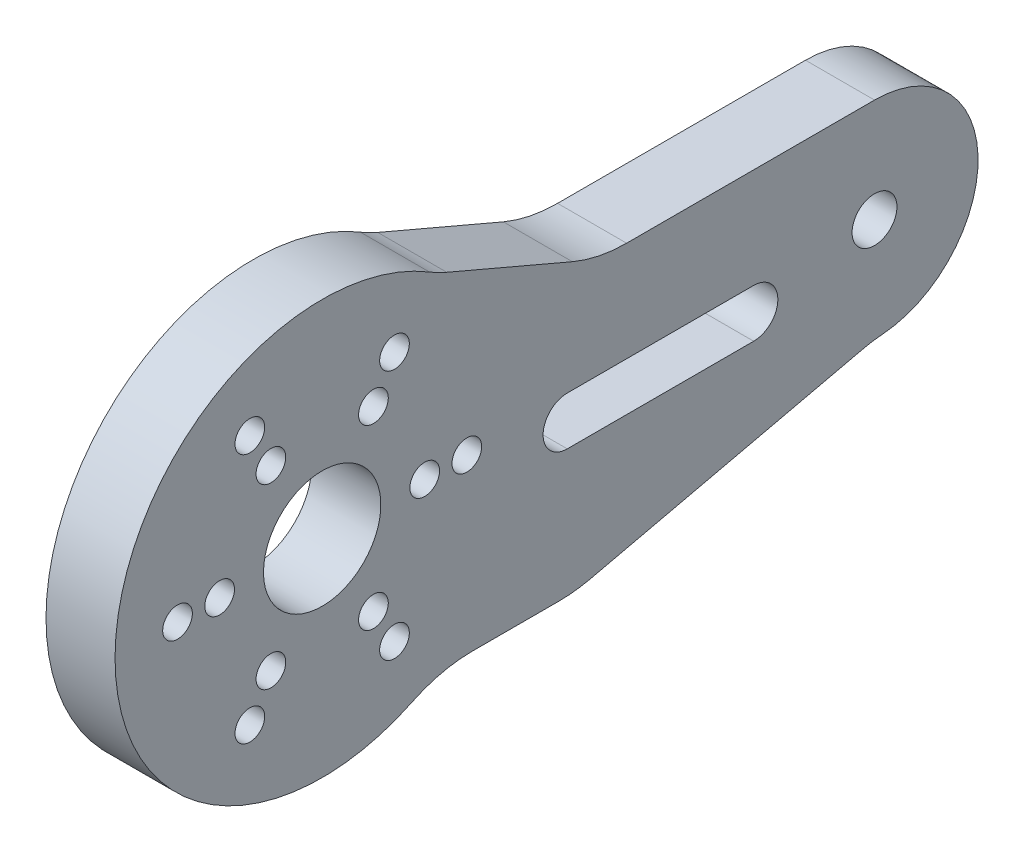
ISO-10303-21;
HEADER;
FILE_DESCRIPTION(('STEP AP214'),'2;1');
FILE_NAME('part.step','',(''),(''),'','','');
FILE_SCHEMA(('AUTOMOTIVE_DESIGN { 1 0 10303 214 1 1 1 1 }'));
ENDSEC;
DATA;
#1=APPLICATION_CONTEXT('core data for automotive mechanical design processes');
#2=APPLICATION_PROTOCOL_DEFINITION('international standard','automotive_design',2000,#1);
#3=PRODUCT_CONTEXT('',#1,'mechanical');
#4=PRODUCT('Part','Part','',(#3));
#5=PRODUCT_RELATED_PRODUCT_CATEGORY('part','',(#4));
#6=PRODUCT_DEFINITION_FORMATION('','',#4);
#7=PRODUCT_DEFINITION_CONTEXT('part definition',#1,'design');
#8=PRODUCT_DEFINITION('design','',#6,#7);
#9=PRODUCT_DEFINITION_SHAPE('','',#8);
#10=(LENGTH_UNIT() NAMED_UNIT(*) SI_UNIT(.MILLI.,.METRE.));
#11=(NAMED_UNIT(*) PLANE_ANGLE_UNIT() SI_UNIT($,.RADIAN.));
#12=(NAMED_UNIT(*) SI_UNIT($,.STERADIAN.) SOLID_ANGLE_UNIT());
#13=UNCERTAINTY_MEASURE_WITH_UNIT(LENGTH_MEASURE(1.E-05),#10,'distance_accuracy_value','');
#14=(GEOMETRIC_REPRESENTATION_CONTEXT(3) GLOBAL_UNCERTAINTY_ASSIGNED_CONTEXT((#13)) GLOBAL_UNIT_ASSIGNED_CONTEXT((#10,
#11,#12)) REPRESENTATION_CONTEXT('',''));
#15=CARTESIAN_POINT('',(0.,0.,0.));
#16=DIRECTION('',(0.,0.,1.));
#17=DIRECTION('',(1.,0.,0.));
#18=AXIS2_PLACEMENT_3D('',#15,#16,#17);
#19=CARTESIAN_POINT('',(2.5,21.3838228847909,-12.9511435337538));
#20=DIRECTION('',(-1.,0.,0.));
#21=DIRECTION('',(0.,0.,1.));
#22=AXIS2_PLACEMENT_3D('',#19,#20,#21);
#23=CYLINDRICAL_SURFACE('',#22,10.);
#24=DIRECTION('',(1.,0.,0.));
#25=VECTOR('',#24,1.);
#26=CARTESIAN_POINT('',(2.5,12.1872890829508,-9.02383325423511));
#27=LINE('',#26,#25);
#28=CARTESIAN_POINT('',(2.5,12.1872890829508,-9.02383325423511));
#29=VERTEX_POINT('',#28);
#30=CARTESIAN_POINT('',(-2.5,12.1872890829508,-9.02383325423511));
#31=VERTEX_POINT('',#30);
#32=EDGE_CURVE('E136',#29,#31,#27,.F.);
#33=ORIENTED_EDGE('',*,*,#32,.T.);
#34=CARTESIAN_POINT('',(-2.5,21.3838228847909,-12.9511435337538));
#35=DIRECTION('',(-1.,0.,0.));
#36=DIRECTION('',(0.,0.,1.));
#37=AXIS2_PLACEMENT_3D('',#34,#35,#36);
#38=CIRCLE('',#37,10.);
#39=CARTESIAN_POINT('',(-2.5,12.8302937308745,-7.77068612025227));
#40=VERTEX_POINT('',#39);
#41=EDGE_CURVE('E19',#40,#31,#38,.F.);
#42=ORIENTED_EDGE('',*,*,#41,.F.);
#43=DIRECTION('',(-1.,0.,0.));
#44=VECTOR('',#43,1.);
#45=CARTESIAN_POINT('',(2.5,12.8302937308745,-7.77068612025227));
#46=LINE('',#45,#44);
#47=CARTESIAN_POINT('',(2.5,12.8302937308745,-7.77068612025227));
#48=VERTEX_POINT('',#47);
#49=EDGE_CURVE('E142',#48,#40,#46,.T.);
#50=ORIENTED_EDGE('',*,*,#49,.F.);
#51=CARTESIAN_POINT('',(2.5,21.3838228847909,-12.9511435337538));
#52=DIRECTION('',(-1.,0.,0.));
#53=DIRECTION('',(0.,0.,1.));
#54=AXIS2_PLACEMENT_3D('',#51,#52,#53);
#55=CIRCLE('',#54,10.);
#56=EDGE_CURVE('E138',#29,#48,#55,.T.);
#57=ORIENTED_EDGE('',*,*,#56,.F.);
#58=EDGE_LOOP('',(#33,#42,#50,#57));
#59=FACE_BOUND('',#58,.T.);
#60=ADVANCED_FACE('F16',(#59),#23,.F.);
#61=CARTESIAN_POINT('',(2.5,-17.4463003681525,-41.3698917709806));
#62=DIRECTION('',(-1.,0.,0.));
#63=DIRECTION('',(0.,0.,1.));
#64=AXIS2_PLACEMENT_3D('',#61,#62,#63);
#65=CYLINDRICAL_SURFACE('',#64,10.);
#66=DIRECTION('',(1.,0.,0.));
#67=VECTOR('',#66,1.);
#68=CARTESIAN_POINT('',(2.5,-7.70144119055183,-39.1254052798805));
#69=LINE('',#68,#67);
#70=CARTESIAN_POINT('',(-2.5,-7.70144119055183,-39.1254052798805));
#71=VERTEX_POINT('',#70);
#72=CARTESIAN_POINT('',(2.5,-7.70144119055183,-39.1254052798805));
#73=VERTEX_POINT('',#72);
#74=EDGE_CURVE('E170',#71,#73,#69,.T.);
#75=ORIENTED_EDGE('',*,*,#74,.F.);
#76=CARTESIAN_POINT('',(-2.5,-17.4463003681525,-41.3698917709806));
#77=DIRECTION('',(-1.,0.,0.));
#78=DIRECTION('',(0.,0.,1.));
#79=AXIS2_PLACEMENT_3D('',#76,#77,#78);
#80=CIRCLE('',#79,10.);
#81=CARTESIAN_POINT('',(-2.5,-7.47698587206537,-40.5870964732774));
#82=VERTEX_POINT('',#81);
#83=EDGE_CURVE('E134',#82,#71,#80,.F.);
#84=ORIENTED_EDGE('',*,*,#83,.F.);
#85=DIRECTION('',(-1.,0.,0.));
#86=VECTOR('',#85,1.);
#87=CARTESIAN_POINT('',(2.5,-7.47698587206537,-40.5870964732774));
#88=LINE('',#87,#86);
#89=CARTESIAN_POINT('',(2.5,-7.47698587206537,-40.5870964732774));
#90=VERTEX_POINT('',#89);
#91=EDGE_CURVE('E196',#90,#82,#88,.T.);
#92=ORIENTED_EDGE('',*,*,#91,.F.);
#93=CARTESIAN_POINT('',(2.5,-17.4463003681525,-41.3698917709806));
#94=DIRECTION('',(-1.,0.,0.));
#95=DIRECTION('',(0.,0.,1.));
#96=AXIS2_PLACEMENT_3D('',#93,#94,#95);
#97=CIRCLE('',#96,10.);
#98=EDGE_CURVE('E323',#73,#90,#97,.T.);
#99=ORIENTED_EDGE('',*,*,#98,.F.);
#100=EDGE_LOOP('',(#75,#84,#92,#99));
#101=FACE_BOUND('',#100,.T.);
#102=ADVANCED_FACE('F329',(#101),#65,.F.);
#103=CARTESIAN_POINT('',(2.5,0.,0.));
#104=DIRECTION('',(1.,0.,0.));
#105=DIRECTION('',(0.,0.,-1.));
#106=AXIS2_PLACEMENT_3D('',#103,#104,#105);
#107=PLANE('',#106);
#108=CARTESIAN_POINT('',(2.5,0.,-40.));
#109=DIRECTION('',(-1.,0.,0.));
#110=DIRECTION('',(0.,0.,1.));
#111=AXIS2_PLACEMENT_3D('',#108,#109,#110);
#112=CIRCLE('',#111,1.625);
#113=CARTESIAN_POINT('',(2.5,0.,-38.375));
#114=VERTEX_POINT('',#113);
#115=EDGE_CURVE('E272',#114,#114,#112,.T.);
#116=ORIENTED_EDGE('',*,*,#115,.T.);
#117=EDGE_LOOP('',(#116));
#118=FACE_BOUND('',#117,.T.);
#119=CARTESIAN_POINT('',(2.5,0.,-10.475));
#120=DIRECTION('',(-1.,0.,0.));
#121=DIRECTION('',(0.,0.,1.));
#122=AXIS2_PLACEMENT_3D('',#119,#120,#121);
#123=CIRCLE('',#122,1.075);
#124=CARTESIAN_POINT('',(2.5,0.,-9.4));
#125=VERTEX_POINT('',#124);
#126=EDGE_CURVE('E275',#125,#125,#123,.T.);
#127=ORIENTED_EDGE('',*,*,#126,.T.);
#128=EDGE_LOOP('',(#127));
#129=FACE_BOUND('',#128,.T.);
#130=CARTESIAN_POINT('',(2.5,0.,-7.425));
#131=DIRECTION('',(-1.,0.,0.));
#132=DIRECTION('',(0.,0.,1.));
#133=AXIS2_PLACEMENT_3D('',#130,#131,#132);
#134=CIRCLE('',#133,1.075);
#135=CARTESIAN_POINT('',(2.5,0.,-6.35));
#136=VERTEX_POINT('',#135);
#137=EDGE_CURVE('E278',#136,#136,#134,.T.);
#138=ORIENTED_EDGE('',*,*,#137,.T.);
#139=EDGE_LOOP('',(#138));
#140=FACE_BOUND('',#139,.T.);
#141=CARTESIAN_POINT('',(2.5,0.,0.));
#142=DIRECTION('',(-1.,0.,0.));
#143=DIRECTION('',(0.,0.,1.));
#144=AXIS2_PLACEMENT_3D('',#141,#142,#143);
#145=CIRCLE('',#144,4.25);
#146=CARTESIAN_POINT('',(2.5,0.,4.25));
#147=VERTEX_POINT('',#146);
#148=EDGE_CURVE('E281',#147,#147,#145,.T.);
#149=ORIENTED_EDGE('',*,*,#148,.T.);
#150=EDGE_LOOP('',(#149));
#151=FACE_BOUND('',#150,.T.);
#152=CARTESIAN_POINT('',(2.5,-6.43023862309946,-3.7125));
#153=DIRECTION('',(-1.,0.,0.));
#154=DIRECTION('',(0.,0.,1.));
#155=AXIS2_PLACEMENT_3D('',#152,#153,#154);
#156=CIRCLE('',#155,1.075);
#157=CARTESIAN_POINT('',(2.5,-6.43023862309946,-2.6375));
#158=VERTEX_POINT('',#157);
#159=EDGE_CURVE('E284',#158,#158,#156,.T.);
#160=ORIENTED_EDGE('',*,*,#159,.T.);
#161=EDGE_LOOP('',(#160));
#162=FACE_BOUND('',#161,.T.);
#163=CARTESIAN_POINT('',(2.5,-9.071616104642,-5.2375));
#164=DIRECTION('',(-1.,0.,0.));
#165=DIRECTION('',(0.,0.,1.));
#166=AXIS2_PLACEMENT_3D('',#163,#164,#165);
#167=CIRCLE('',#166,1.075);
#168=CARTESIAN_POINT('',(2.5,-9.071616104642,-4.1625));
#169=VERTEX_POINT('',#168);
#170=EDGE_CURVE('E287',#169,#169,#167,.T.);
#171=ORIENTED_EDGE('',*,*,#170,.T.);
#172=EDGE_LOOP('',(#171));
#173=FACE_BOUND('',#172,.T.);
#174=CARTESIAN_POINT('',(2.5,-6.43023862309946,3.7125));
#175=DIRECTION('',(-1.,0.,0.));
#176=DIRECTION('',(0.,0.,1.));
#177=AXIS2_PLACEMENT_3D('',#174,#175,#176);
#178=CIRCLE('',#177,1.075);
#179=CARTESIAN_POINT('',(2.5,-6.43023862309946,4.7875));
#180=VERTEX_POINT('',#179);
#181=EDGE_CURVE('E290',#180,#180,#178,.T.);
#182=ORIENTED_EDGE('',*,*,#181,.T.);
#183=EDGE_LOOP('',(#182));
#184=FACE_BOUND('',#183,.T.);
#185=CARTESIAN_POINT('',(2.5,-9.071616104642,5.2375));
#186=DIRECTION('',(-1.,0.,0.));
#187=DIRECTION('',(0.,0.,1.));
#188=AXIS2_PLACEMENT_3D('',#185,#186,#187);
#189=CIRCLE('',#188,1.075);
#190=CARTESIAN_POINT('',(2.5,-9.071616104642,6.3125));
#191=VERTEX_POINT('',#190);
#192=EDGE_CURVE('E293',#191,#191,#189,.T.);
#193=ORIENTED_EDGE('',*,*,#192,.T.);
#194=EDGE_LOOP('',(#193));
#195=FACE_BOUND('',#194,.T.);
#196=CARTESIAN_POINT('',(2.5,0.,7.425));
#197=DIRECTION('',(-1.,0.,0.));
#198=DIRECTION('',(0.,0.,1.));
#199=AXIS2_PLACEMENT_3D('',#196,#197,#198);
#200=CIRCLE('',#199,1.075);
#201=CARTESIAN_POINT('',(2.5,0.,8.5));
#202=VERTEX_POINT('',#201);
#203=EDGE_CURVE('E296',#202,#202,#200,.T.);
#204=ORIENTED_EDGE('',*,*,#203,.T.);
#205=EDGE_LOOP('',(#204));
#206=FACE_BOUND('',#205,.T.);
#207=CARTESIAN_POINT('',(2.5,0.,10.475));
#208=DIRECTION('',(-1.,0.,0.));
#209=DIRECTION('',(0.,0.,1.));
#210=AXIS2_PLACEMENT_3D('',#207,#208,#209);
#211=CIRCLE('',#210,1.075);
#212=CARTESIAN_POINT('',(2.5,0.,11.55));
#213=VERTEX_POINT('',#212);
#214=EDGE_CURVE('E299',#213,#213,#211,.T.);
#215=ORIENTED_EDGE('',*,*,#214,.T.);
#216=EDGE_LOOP('',(#215));
#217=FACE_BOUND('',#216,.T.);
#218=CARTESIAN_POINT('',(2.5,6.43023862309946,3.7125));
#219=DIRECTION('',(-1.,0.,0.));
#220=DIRECTION('',(0.,0.,1.));
#221=AXIS2_PLACEMENT_3D('',#218,#219,#220);
#222=CIRCLE('',#221,1.075);
#223=CARTESIAN_POINT('',(2.5,6.43023862309946,4.7875));
#224=VERTEX_POINT('',#223);
#225=EDGE_CURVE('E302',#224,#224,#222,.T.);
#226=ORIENTED_EDGE('',*,*,#225,.T.);
#227=EDGE_LOOP('',(#226));
#228=FACE_BOUND('',#227,.T.);
#229=CARTESIAN_POINT('',(2.5,9.07161610464199,5.23750000000001));
#230=DIRECTION('',(-1.,0.,0.));
#231=DIRECTION('',(0.,0.,1.));
#232=AXIS2_PLACEMENT_3D('',#229,#230,#231);
#233=CIRCLE('',#232,1.075);
#234=CARTESIAN_POINT('',(2.5,9.07161610464199,6.3125));
#235=VERTEX_POINT('',#234);
#236=EDGE_CURVE('E305',#235,#235,#233,.T.);
#237=ORIENTED_EDGE('',*,*,#236,.T.);
#238=EDGE_LOOP('',(#237));
#239=FACE_BOUND('',#238,.T.);
#240=CARTESIAN_POINT('',(2.5,6.43023862309946,-3.7125));
#241=DIRECTION('',(-1.,0.,0.));
#242=DIRECTION('',(0.,0.,1.));
#243=AXIS2_PLACEMENT_3D('',#240,#241,#242);
#244=CIRCLE('',#243,1.075);
#245=CARTESIAN_POINT('',(2.5,6.43023862309946,-2.6375));
#246=VERTEX_POINT('',#245);
#247=EDGE_CURVE('E308',#246,#246,#244,.T.);
#248=ORIENTED_EDGE('',*,*,#247,.T.);
#249=EDGE_LOOP('',(#248));
#250=FACE_BOUND('',#249,.T.);
#251=CARTESIAN_POINT('',(2.5,9.071616104642,-5.2375));
#252=DIRECTION('',(-1.,0.,0.));
#253=DIRECTION('',(0.,0.,1.));
#254=AXIS2_PLACEMENT_3D('',#251,#252,#253);
#255=CIRCLE('',#254,1.075);
#256=CARTESIAN_POINT('',(2.5,9.071616104642,-4.1625));
#257=VERTEX_POINT('',#256);
#258=EDGE_CURVE('E174',#257,#257,#255,.T.);
#259=ORIENTED_EDGE('',*,*,#258,.T.);
#260=EDGE_LOOP('',(#259));
#261=FACE_BOUND('',#260,.T.);
#262=CARTESIAN_POINT('',(2.5,0.,0.));
#263=DIRECTION('',(-1.,0.,0.));
#264=DIRECTION('',(0.,0.,1.));
#265=AXIS2_PLACEMENT_3D('',#262,#263,#264);
#266=CIRCLE('',#265,15.);
#267=CARTESIAN_POINT('',(2.5,-13.5,-6.53834841531101));
#268=VERTEX_POINT('',#267);
#269=EDGE_CURVE('E185',#268,#48,#266,.T.);
#270=ORIENTED_EDGE('',*,*,#269,.F.);
#271=CARTESIAN_POINT('',(2.5,-22.5,-10.8972473588517));
#272=DIRECTION('',(-1.,0.,0.));
#273=DIRECTION('',(0.,0.,1.));
#274=AXIS2_PLACEMENT_3D('',#271,#272,#273);
#275=CIRCLE('',#274,10.);
#276=CARTESIAN_POINT('',(2.5,-12.5,-10.8972473588517));
#277=VERTEX_POINT('',#276);
#278=EDGE_CURVE('E184',#268,#277,#275,.T.);
#279=ORIENTED_EDGE('',*,*,#278,.T.);
#280=DIRECTION('',(0.,0.,-1.));
#281=VECTOR('',#280,1.);
#282=CARTESIAN_POINT('',(2.5,-12.5,0.));
#283=LINE('',#282,#281);
#284=CARTESIAN_POINT('',(2.5,-12.5,-17.1548172308835));
#285=VERTEX_POINT('',#284);
#286=EDGE_CURVE('E180',#285,#277,#283,.F.);
#287=ORIENTED_EDGE('',*,*,#286,.F.);
#288=CARTESIAN_POINT('',(2.5,-2.5,-17.1548172308835));
#289=DIRECTION('',(-1.,0.,0.));
#290=DIRECTION('',(0.,0.,1.));
#291=AXIS2_PLACEMENT_3D('',#288,#289,#290);
#292=CIRCLE('',#291,10.);
#293=CARTESIAN_POINT('',(2.5,-12.2448591776007,-19.3993037219836));
#294=VERTEX_POINT('',#293);
#295=EDGE_CURVE('E177',#294,#285,#292,.T.);
#296=ORIENTED_EDGE('',*,*,#295,.F.);
#297=DIRECTION('',(0.,0.224448649110017,-0.974485917760071));
#298=VECTOR('',#297,1.);
#299=CARTESIAN_POINT('',(2.5,-15.8710529420645,-3.65550320212734));
#300=LINE('',#299,#298);
#301=EDGE_CURVE('E171',#73,#294,#300,.F.);
#302=ORIENTED_EDGE('',*,*,#301,.F.);
#303=ORIENTED_EDGE('',*,*,#98,.T.);
#304=CARTESIAN_POINT('',(2.5,0.,-40.));
#305=DIRECTION('',(-1.,0.,0.));
#306=DIRECTION('',(0.,0.,1.));
#307=AXIS2_PLACEMENT_3D('',#304,#305,#306);
#308=CIRCLE('',#307,7.5);
#309=CARTESIAN_POINT('',(2.5,7.5,-40.));
#310=VERTEX_POINT('',#309);
#311=EDGE_CURVE('E199',#310,#90,#308,.T.);
#312=ORIENTED_EDGE('',*,*,#311,.F.);
#313=DIRECTION('',(0.,0.,-1.));
#314=VECTOR('',#313,1.);
#315=CARTESIAN_POINT('',(2.5,7.49999999999999,0.));
#316=LINE('',#315,#314);
#317=CARTESIAN_POINT('',(2.5,7.5,-22.0458434423939));
#318=VERTEX_POINT('',#317);
#319=EDGE_CURVE('E192',#310,#318,#316,.F.);
#320=ORIENTED_EDGE('',*,*,#319,.T.);
#321=CARTESIAN_POINT('',(2.5,17.5,-22.0458434423939));
#322=DIRECTION('',(1.,0.,0.));
#323=DIRECTION('',(0.,0.,-1.));
#324=AXIS2_PLACEMENT_3D('',#321,#322,#323);
#325=CIRCLE('',#324,10.);
#326=CARTESIAN_POINT('',(2.5,8.30346619815993,-18.1185331628752));
#327=VERTEX_POINT('',#326);
#328=EDGE_CURVE('E187',#318,#327,#325,.F.);
#329=ORIENTED_EDGE('',*,*,#328,.T.);
#330=DIRECTION('',(0.,-0.392731027951867,-0.919653380184007));
#331=VECTOR('',#330,1.);
#332=CARTESIAN_POINT('',(2.5,13.5667458948105,-5.79357633651566));
#333=LINE('',#332,#331);
#334=EDGE_CURVE('E143',#327,#29,#333,.F.);
#335=ORIENTED_EDGE('',*,*,#334,.T.);
#336=ORIENTED_EDGE('',*,*,#56,.T.);
#337=EDGE_LOOP('',(#270,#279,#287,#296,#302,#303,#312,#320,#329,#335,#336));
#338=FACE_BOUND('',#337,.T.);
#339=CARTESIAN_POINT('',(2.5,-1.5,-31.25));
#340=DIRECTION('',(1.,0.,0.));
#341=DIRECTION('',(0.,0.,-1.));
#342=AXIS2_PLACEMENT_3D('',#339,#340,#341);
#343=CIRCLE('',#342,1.75);
#344=CARTESIAN_POINT('',(2.5,0.25,-31.25));
#345=VERTEX_POINT('',#344);
#346=CARTESIAN_POINT('',(2.5,-3.25,-31.25));
#347=VERTEX_POINT('',#346);
#348=EDGE_CURVE('E215',#345,#347,#343,.F.);
#349=ORIENTED_EDGE('',*,*,#348,.T.);
#350=DIRECTION('',(0.,0.,-1.));
#351=VECTOR('',#350,1.);
#352=CARTESIAN_POINT('',(2.5,-3.25,-17.75));
#353=LINE('',#352,#351);
#354=CARTESIAN_POINT('',(2.5,-3.25,-17.75));
#355=VERTEX_POINT('',#354);
#356=EDGE_CURVE('E211',#347,#355,#353,.F.);
#357=ORIENTED_EDGE('',*,*,#356,.T.);
#358=CARTESIAN_POINT('',(2.5,-1.5,-17.75));
#359=DIRECTION('',(1.,0.,0.));
#360=DIRECTION('',(0.,0.,-1.));
#361=AXIS2_PLACEMENT_3D('',#358,#359,#360);
#362=CIRCLE('',#361,1.75);
#363=CARTESIAN_POINT('',(2.5,0.25,-17.75));
#364=VERTEX_POINT('',#363);
#365=EDGE_CURVE('E207',#355,#364,#362,.F.);
#366=ORIENTED_EDGE('',*,*,#365,.T.);
#367=DIRECTION('',(0.,0.,1.));
#368=VECTOR('',#367,1.);
#369=CARTESIAN_POINT('',(2.5,0.25,-17.75));
#370=LINE('',#369,#368);
#371=EDGE_CURVE('E203',#364,#345,#370,.F.);
#372=ORIENTED_EDGE('',*,*,#371,.T.);
#373=EDGE_LOOP('',(#349,#357,#366,#372));
#374=FACE_BOUND('',#373,.T.);
#375=ADVANCED_FACE('F411',(#118,#129,#140,#151,#162,#173,#184,#195,#206,#217,#228,#239,#250,
#261,#338,#374),#107,.T.);
#376=CARTESIAN_POINT('',(-2.5,-1.5,-31.25));
#377=DIRECTION('',(1.,0.,0.));
#378=DIRECTION('',(0.,0.,-1.));
#379=AXIS2_PLACEMENT_3D('',#376,#377,#378);
#380=CYLINDRICAL_SURFACE('',#379,1.75);
#381=CARTESIAN_POINT('',(-2.5,-1.5,-31.25));
#382=DIRECTION('',(1.,0.,0.));
#383=DIRECTION('',(0.,0.,-1.));
#384=AXIS2_PLACEMENT_3D('',#381,#382,#383);
#385=CIRCLE('',#384,1.75);
#386=CARTESIAN_POINT('',(-2.5,0.25,-31.25));
#387=VERTEX_POINT('',#386);
#388=CARTESIAN_POINT('',(-2.5,-3.25,-31.25));
#389=VERTEX_POINT('',#388);
#390=EDGE_CURVE('E168',#387,#389,#385,.F.);
#391=ORIENTED_EDGE('',*,*,#390,.T.);
#392=DIRECTION('',(1.,0.,0.));
#393=VECTOR('',#392,1.);
#394=CARTESIAN_POINT('',(-2.5,-3.25,-31.25));
#395=LINE('',#394,#393);
#396=EDGE_CURVE('E212',#389,#347,#395,.T.);
#397=ORIENTED_EDGE('',*,*,#396,.T.);
#398=ORIENTED_EDGE('',*,*,#348,.F.);
#399=DIRECTION('',(1.,0.,0.));
#400=VECTOR('',#399,1.);
#401=CARTESIAN_POINT('',(-2.5,0.25,-31.25));
#402=LINE('',#401,#400);
#403=EDGE_CURVE('E204',#345,#387,#402,.F.);
#404=ORIENTED_EDGE('',*,*,#403,.T.);
#405=EDGE_LOOP('',(#391,#397,#398,#404));
#406=FACE_BOUND('',#405,.T.);
#407=ADVANCED_FACE('F414',(#406),#380,.F.);
#408=CARTESIAN_POINT('',(-2.5,-3.25,-17.75));
#409=DIRECTION('',(0.,-1.,0.));
#410=DIRECTION('',(0.,0.,-1.));
#411=AXIS2_PLACEMENT_3D('',#408,#409,#410);
#412=PLANE('',#411);
#413=ORIENTED_EDGE('',*,*,#396,.F.);
#414=DIRECTION('',(0.,0.,-1.));
#415=VECTOR('',#414,1.);
#416=CARTESIAN_POINT('',(-2.5,-3.25,0.));
#417=LINE('',#416,#415);
#418=CARTESIAN_POINT('',(-2.5,-3.25,-17.75));
#419=VERTEX_POINT('',#418);
#420=EDGE_CURVE('E165',#389,#419,#417,.F.);
#421=ORIENTED_EDGE('',*,*,#420,.T.);
#422=DIRECTION('',(1.,0.,0.));
#423=VECTOR('',#422,1.);
#424=CARTESIAN_POINT('',(-2.5,-3.25,-17.75));
#425=LINE('',#424,#423);
#426=EDGE_CURVE('E208',#419,#355,#425,.T.);
#427=ORIENTED_EDGE('',*,*,#426,.T.);
#428=ORIENTED_EDGE('',*,*,#356,.F.);
#429=EDGE_LOOP('',(#413,#421,#427,#428));
#430=FACE_BOUND('',#429,.T.);
#431=ADVANCED_FACE('F428',(#430),#412,.F.);
#432=CARTESIAN_POINT('',(-2.5,-1.5,-17.75));
#433=DIRECTION('',(1.,0.,0.));
#434=DIRECTION('',(0.,0.,-1.));
#435=AXIS2_PLACEMENT_3D('',#432,#433,#434);
#436=CYLINDRICAL_SURFACE('',#435,1.75);
#437=ORIENTED_EDGE('',*,*,#426,.F.);
#438=CARTESIAN_POINT('',(-2.5,-1.5,-17.75));
#439=DIRECTION('',(1.,0.,0.));
#440=DIRECTION('',(0.,0.,-1.));
#441=AXIS2_PLACEMENT_3D('',#438,#439,#440);
#442=CIRCLE('',#441,1.75);
#443=CARTESIAN_POINT('',(-2.5,0.25,-17.75));
#444=VERTEX_POINT('',#443);
#445=EDGE_CURVE('E164',#419,#444,#442,.F.);
#446=ORIENTED_EDGE('',*,*,#445,.T.);
#447=DIRECTION('',(1.,0.,0.));
#448=VECTOR('',#447,1.);
#449=CARTESIAN_POINT('',(-2.5,0.25,-17.75));
#450=LINE('',#449,#448);
#451=EDGE_CURVE('E200',#444,#364,#450,.T.);
#452=ORIENTED_EDGE('',*,*,#451,.T.);
#453=ORIENTED_EDGE('',*,*,#365,.F.);
#454=EDGE_LOOP('',(#437,#446,#452,#453));
#455=FACE_BOUND('',#454,.T.);
#456=ADVANCED_FACE('F433',(#455),#436,.F.);
#457=CARTESIAN_POINT('',(-2.5,0.25,-17.75));
#458=DIRECTION('',(0.,1.,0.));
#459=DIRECTION('',(0.,0.,1.));
#460=AXIS2_PLACEMENT_3D('',#457,#458,#459);
#461=PLANE('',#460);
#462=ORIENTED_EDGE('',*,*,#451,.F.);
#463=DIRECTION('',(0.,0.,-1.));
#464=VECTOR('',#463,1.);
#465=CARTESIAN_POINT('',(-2.5,0.25,0.));
#466=LINE('',#465,#464);
#467=EDGE_CURVE('E161',#444,#387,#466,.T.);
#468=ORIENTED_EDGE('',*,*,#467,.T.);
#469=ORIENTED_EDGE('',*,*,#403,.F.);
#470=ORIENTED_EDGE('',*,*,#371,.F.);
#471=EDGE_LOOP('',(#462,#468,#469,#470));
#472=FACE_BOUND('',#471,.T.);
#473=ADVANCED_FACE('F435',(#472),#461,.F.);
#474=CARTESIAN_POINT('',(2.5,0.,-40.));
#475=DIRECTION('',(-1.,0.,0.));
#476=DIRECTION('',(0.,0.,1.));
#477=AXIS2_PLACEMENT_3D('',#474,#475,#476);
#478=CYLINDRICAL_SURFACE('',#477,7.5);
#479=CARTESIAN_POINT('',(-2.5,0.,-40.));
#480=DIRECTION('',(-1.,0.,0.));
#481=DIRECTION('',(0.,0.,1.));
#482=AXIS2_PLACEMENT_3D('',#479,#480,#481);
#483=CIRCLE('',#482,7.5);
#484=CARTESIAN_POINT('',(-2.5,7.5,-40.));
#485=VERTEX_POINT('',#484);
#486=EDGE_CURVE('E160',#82,#485,#483,.F.);
#487=ORIENTED_EDGE('',*,*,#486,.T.);
#488=DIRECTION('',(1.,0.,0.));
#489=VECTOR('',#488,1.);
#490=CARTESIAN_POINT('',(2.5,7.5,-40.));
#491=LINE('',#490,#489);
#492=EDGE_CURVE('E193',#485,#310,#491,.T.);
#493=ORIENTED_EDGE('',*,*,#492,.T.);
#494=ORIENTED_EDGE('',*,*,#311,.T.);
#495=ORIENTED_EDGE('',*,*,#91,.T.);
#496=EDGE_LOOP('',(#487,#493,#494,#495));
#497=FACE_BOUND('',#496,.T.);
#498=ADVANCED_FACE('F437',(#497),#478,.T.);
#499=CARTESIAN_POINT('',(2.5,7.49999999999999,0.));
#500=DIRECTION('',(0.,-1.,0.));
#501=DIRECTION('',(0.,0.,-1.));
#502=AXIS2_PLACEMENT_3D('',#499,#500,#501);
#503=PLANE('',#502);
#504=DIRECTION('',(1.,0.,0.));
#505=VECTOR('',#504,1.);
#506=CARTESIAN_POINT('',(2.5,7.5,-22.0458434423939));
#507=LINE('',#506,#505);
#508=CARTESIAN_POINT('',(-2.5,7.5,-22.0458434423939));
#509=VERTEX_POINT('',#508);
#510=EDGE_CURVE('E189',#509,#318,#507,.T.);
#511=ORIENTED_EDGE('',*,*,#510,.T.);
#512=ORIENTED_EDGE('',*,*,#319,.F.);
#513=ORIENTED_EDGE('',*,*,#492,.F.);
#514=DIRECTION('',(0.,0.,-1.));
#515=VECTOR('',#514,1.);
#516=CARTESIAN_POINT('',(-2.5,7.5,0.));
#517=LINE('',#516,#515);
#518=EDGE_CURVE('E152',#485,#509,#517,.F.);
#519=ORIENTED_EDGE('',*,*,#518,.T.);
#520=EDGE_LOOP('',(#511,#512,#513,#519));
#521=FACE_BOUND('',#520,.T.);
#522=ADVANCED_FACE('F443',(#521),#503,.F.);
#523=CARTESIAN_POINT('',(2.5,17.5,-22.0458434423939));
#524=DIRECTION('',(1.,0.,0.));
#525=DIRECTION('',(0.,0.,-1.));
#526=AXIS2_PLACEMENT_3D('',#523,#524,#525);
#527=CYLINDRICAL_SURFACE('',#526,10.);
#528=ORIENTED_EDGE('',*,*,#510,.F.);
#529=CARTESIAN_POINT('',(-2.5,17.5,-22.0458434423939));
#530=DIRECTION('',(1.,0.,0.));
#531=DIRECTION('',(0.,0.,-1.));
#532=AXIS2_PLACEMENT_3D('',#529,#530,#531);
#533=CIRCLE('',#532,10.);
#534=CARTESIAN_POINT('',(-2.5,8.30346619815993,-18.1185331628752));
#535=VERTEX_POINT('',#534);
#536=EDGE_CURVE('E148',#509,#535,#533,.F.);
#537=ORIENTED_EDGE('',*,*,#536,.T.);
#538=DIRECTION('',(1.,0.,0.));
#539=VECTOR('',#538,1.);
#540=CARTESIAN_POINT('',(2.5,8.30346619815993,-18.1185331628752));
#541=LINE('',#540,#539);
#542=EDGE_CURVE('E147',#535,#327,#541,.T.);
#543=ORIENTED_EDGE('',*,*,#542,.T.);
#544=ORIENTED_EDGE('',*,*,#328,.F.);
#545=EDGE_LOOP('',(#528,#537,#543,#544));
#546=FACE_BOUND('',#545,.T.);
#547=ADVANCED_FACE('F515',(#546),#527,.F.);
#548=CARTESIAN_POINT('',(2.5,13.5667458948105,-5.79357633651566));
#549=DIRECTION('',(0.,-0.919653380184007,0.392731027951867));
#550=DIRECTION('',(0.,-0.392731027951867,-0.919653380184007));
#551=AXIS2_PLACEMENT_3D('',#548,#549,#550);
#552=PLANE('',#551);
#553=ORIENTED_EDGE('',*,*,#32,.F.);
#554=ORIENTED_EDGE('',*,*,#334,.F.);
#555=ORIENTED_EDGE('',*,*,#542,.F.);
#556=DIRECTION('',(0.,0.392731027951867,0.919653380184007));
#557=VECTOR('',#556,1.);
#558=CARTESIAN_POINT('',(-2.5,8.30346619815993,-18.1185331628752));
#559=LINE('',#558,#557);
#560=EDGE_CURVE('E130',#535,#31,#559,.T.);
#561=ORIENTED_EDGE('',*,*,#560,.T.);
#562=EDGE_LOOP('',(#553,#554,#555,#561));
#563=FACE_BOUND('',#562,.T.);
#564=ADVANCED_FACE('F145',(#563),#552,.F.);
#565=CARTESIAN_POINT('',(2.5,0.,0.));
#566=DIRECTION('',(-1.,0.,0.));
#567=DIRECTION('',(0.,0.,1.));
#568=AXIS2_PLACEMENT_3D('',#565,#566,#567);
#569=CYLINDRICAL_SURFACE('',#568,15.);
#570=CARTESIAN_POINT('',(-2.5,0.,0.));
#571=DIRECTION('',(-1.,0.,0.));
#572=DIRECTION('',(0.,0.,1.));
#573=AXIS2_PLACEMENT_3D('',#570,#571,#572);
#574=CIRCLE('',#573,15.);
#575=CARTESIAN_POINT('',(-2.5,-13.5,-6.53834841531101));
#576=VERTEX_POINT('',#575);
#577=EDGE_CURVE('E133',#40,#576,#574,.F.);
#578=ORIENTED_EDGE('',*,*,#577,.T.);
#579=DIRECTION('',(-1.,0.,0.));
#580=VECTOR('',#579,1.);
#581=CARTESIAN_POINT('',(2.5,-13.5,-6.53834841531101));
#582=LINE('',#581,#580);
#583=EDGE_CURVE('E181',#576,#268,#582,.F.);
#584=ORIENTED_EDGE('',*,*,#583,.T.);
#585=ORIENTED_EDGE('',*,*,#269,.T.);
#586=ORIENTED_EDGE('',*,*,#49,.T.);
#587=EDGE_LOOP('',(#578,#584,#585,#586));
#588=FACE_BOUND('',#587,.T.);
#589=ADVANCED_FACE('F533',(#588),#569,.T.);
#590=CARTESIAN_POINT('',(2.5,-22.5,-10.8972473588517));
#591=DIRECTION('',(-1.,0.,0.));
#592=DIRECTION('',(0.,0.,1.));
#593=AXIS2_PLACEMENT_3D('',#590,#591,#592);
#594=CYLINDRICAL_SURFACE('',#593,10.);
#595=ORIENTED_EDGE('',*,*,#583,.F.);
#596=CARTESIAN_POINT('',(-2.5,-22.5,-10.8972473588517));
#597=DIRECTION('',(-1.,0.,0.));
#598=DIRECTION('',(0.,0.,1.));
#599=AXIS2_PLACEMENT_3D('',#596,#597,#598);
#600=CIRCLE('',#599,10.);
#601=CARTESIAN_POINT('',(-2.5,-12.5,-10.8972473588517));
#602=VERTEX_POINT('',#601);
#603=EDGE_CURVE('E150',#576,#602,#600,.T.);
#604=ORIENTED_EDGE('',*,*,#603,.T.);
#605=DIRECTION('',(1.,0.,0.));
#606=VECTOR('',#605,1.);
#607=CARTESIAN_POINT('',(2.5,-12.5,-10.8972473588517));
#608=LINE('',#607,#606);
#609=EDGE_CURVE('E178',#277,#602,#608,.F.);
#610=ORIENTED_EDGE('',*,*,#609,.F.);
#611=ORIENTED_EDGE('',*,*,#278,.F.);
#612=EDGE_LOOP('',(#595,#604,#610,#611));
#613=FACE_BOUND('',#612,.T.);
#614=ADVANCED_FACE('F542',(#613),#594,.F.);
#615=CARTESIAN_POINT('',(2.5,-12.5,0.));
#616=DIRECTION('',(0.,-1.,0.));
#617=DIRECTION('',(0.,0.,-1.));
#618=AXIS2_PLACEMENT_3D('',#615,#616,#617);
#619=PLANE('',#618);
#620=ORIENTED_EDGE('',*,*,#286,.T.);
#621=ORIENTED_EDGE('',*,*,#609,.T.);
#622=DIRECTION('',(0.,0.,-1.));
#623=VECTOR('',#622,1.);
#624=CARTESIAN_POINT('',(-2.5,-12.5,0.));
#625=LINE('',#624,#623);
#626=CARTESIAN_POINT('',(-2.5,-12.5,-17.1548172308835));
#627=VERTEX_POINT('',#626);
#628=EDGE_CURVE('E156',#602,#627,#625,.T.);
#629=ORIENTED_EDGE('',*,*,#628,.T.);
#630=DIRECTION('',(-1.,0.,0.));
#631=VECTOR('',#630,1.);
#632=CARTESIAN_POINT('',(2.5,-12.5,-17.1548172308835));
#633=LINE('',#632,#631);
#634=EDGE_CURVE('E175',#285,#627,#633,.T.);
#635=ORIENTED_EDGE('',*,*,#634,.F.);
#636=EDGE_LOOP('',(#620,#621,#629,#635));
#637=FACE_BOUND('',#636,.T.);
#638=ADVANCED_FACE('F344',(#637),#619,.T.);
#639=CARTESIAN_POINT('',(2.5,-2.5,-17.1548172308835));
#640=DIRECTION('',(-1.,0.,0.));
#641=DIRECTION('',(0.,0.,1.));
#642=AXIS2_PLACEMENT_3D('',#639,#640,#641);
#643=CYLINDRICAL_SURFACE('',#642,10.);
#644=CARTESIAN_POINT('',(-2.5,-2.5,-17.1548172308835));
#645=DIRECTION('',(-1.,0.,0.));
#646=DIRECTION('',(0.,0.,1.));
#647=AXIS2_PLACEMENT_3D('',#644,#645,#646);
#648=CIRCLE('',#647,10.);
#649=CARTESIAN_POINT('',(-2.5,-12.2448591776007,-19.3993037219836));
#650=VERTEX_POINT('',#649);
#651=EDGE_CURVE('E262',#627,#650,#648,.F.);
#652=ORIENTED_EDGE('',*,*,#651,.T.);
#653=DIRECTION('',(1.,0.,0.));
#654=VECTOR('',#653,1.);
#655=CARTESIAN_POINT('',(2.5,-12.2448591776007,-19.3993037219836));
#656=LINE('',#655,#654);
#657=EDGE_CURVE('E34',#294,#650,#656,.F.);
#658=ORIENTED_EDGE('',*,*,#657,.F.);
#659=ORIENTED_EDGE('',*,*,#295,.T.);
#660=ORIENTED_EDGE('',*,*,#634,.T.);
#661=EDGE_LOOP('',(#652,#658,#659,#660));
#662=FACE_BOUND('',#661,.T.);
#663=ADVANCED_FACE('F334',(#662),#643,.T.);
#664=CARTESIAN_POINT('',(2.5,-15.8710529420645,-3.65550320212734));
#665=DIRECTION('',(0.,-0.974485917760071,-0.224448649110017));
#666=DIRECTION('',(0.,0.224448649110017,-0.974485917760071));
#667=AXIS2_PLACEMENT_3D('',#664,#665,#666);
#668=PLANE('',#667);
#669=DIRECTION('',(0.,0.224448649110017,-0.974485917760071));
#670=VECTOR('',#669,1.);
#671=CARTESIAN_POINT('',(-2.5,-12.2448591776007,-19.3993037219836));
#672=LINE('',#671,#670);
#673=EDGE_CURVE('E261',#650,#71,#672,.T.);
#674=ORIENTED_EDGE('',*,*,#673,.T.);
#675=ORIENTED_EDGE('',*,*,#74,.T.);
#676=ORIENTED_EDGE('',*,*,#301,.T.);
#677=ORIENTED_EDGE('',*,*,#657,.T.);
#678=EDGE_LOOP('',(#674,#675,#676,#677));
#679=FACE_BOUND('',#678,.T.);
#680=ADVANCED_FACE('F331',(#679),#668,.T.);
#681=CARTESIAN_POINT('',(2.5,9.071616104642,-5.2375));
#682=DIRECTION('',(-1.,0.,0.));
#683=DIRECTION('',(0.,0.,1.));
#684=AXIS2_PLACEMENT_3D('',#681,#682,#683);
#685=CYLINDRICAL_SURFACE('',#684,1.075);
#686=CARTESIAN_POINT('',(-2.5,9.071616104642,-5.2375));
#687=DIRECTION('',(-1.,0.,0.));
#688=DIRECTION('',(0.,0.,1.));
#689=AXIS2_PLACEMENT_3D('',#686,#687,#688);
#690=CIRCLE('',#689,1.075);
#691=CARTESIAN_POINT('',(-2.5,9.071616104642,-4.1625));
#692=VERTEX_POINT('',#691);
#693=EDGE_CURVE('E258',#692,#692,#690,.T.);
#694=ORIENTED_EDGE('',*,*,#693,.T.);
#695=EDGE_LOOP('',(#694));
#696=FACE_BOUND('',#695,.T.);
#697=ORIENTED_EDGE('',*,*,#258,.F.);
#698=EDGE_LOOP('',(#697));
#699=FACE_BOUND('',#698,.T.);
#700=ADVANCED_FACE('F333',(#696,#699),#685,.F.);
#701=CARTESIAN_POINT('',(2.5,6.43023862309946,-3.7125));
#702=DIRECTION('',(-1.,0.,0.));
#703=DIRECTION('',(0.,0.,1.));
#704=AXIS2_PLACEMENT_3D('',#701,#702,#703);
#705=CYLINDRICAL_SURFACE('',#704,1.075);
#706=CARTESIAN_POINT('',(-2.5,6.43023862309946,-3.7125));
#707=DIRECTION('',(-1.,0.,0.));
#708=DIRECTION('',(0.,0.,1.));
#709=AXIS2_PLACEMENT_3D('',#706,#707,#708);
#710=CIRCLE('',#709,1.075);
#711=CARTESIAN_POINT('',(-2.5,6.43023862309946,-2.6375));
#712=VERTEX_POINT('',#711);
#713=EDGE_CURVE('E255',#712,#712,#710,.T.);
#714=ORIENTED_EDGE('',*,*,#713,.T.);
#715=EDGE_LOOP('',(#714));
#716=FACE_BOUND('',#715,.T.);
#717=ORIENTED_EDGE('',*,*,#247,.F.);
#718=EDGE_LOOP('',(#717));
#719=FACE_BOUND('',#718,.T.);
#720=ADVANCED_FACE('F341',(#716,#719),#705,.F.);
#721=CARTESIAN_POINT('',(2.5,9.07161610464199,5.23750000000001));
#722=DIRECTION('',(-1.,0.,0.));
#723=DIRECTION('',(0.,0.,1.));
#724=AXIS2_PLACEMENT_3D('',#721,#722,#723);
#725=CYLINDRICAL_SURFACE('',#724,1.075);
#726=CARTESIAN_POINT('',(-2.5,9.07161610464199,5.23750000000001));
#727=DIRECTION('',(-1.,0.,0.));
#728=DIRECTION('',(0.,0.,1.));
#729=AXIS2_PLACEMENT_3D('',#726,#727,#728);
#730=CIRCLE('',#729,1.075);
#731=CARTESIAN_POINT('',(-2.5,9.07161610464199,6.3125));
#732=VERTEX_POINT('',#731);
#733=EDGE_CURVE('E252',#732,#732,#730,.T.);
#734=ORIENTED_EDGE('',*,*,#733,.T.);
#735=EDGE_LOOP('',(#734));
#736=FACE_BOUND('',#735,.T.);
#737=ORIENTED_EDGE('',*,*,#236,.F.);
#738=EDGE_LOOP('',(#737));
#739=FACE_BOUND('',#738,.T.);
#740=ADVANCED_FACE('F398',(#736,#739),#725,.F.);
#741=CARTESIAN_POINT('',(2.5,6.43023862309946,3.7125));
#742=DIRECTION('',(-1.,0.,0.));
#743=DIRECTION('',(0.,0.,1.));
#744=AXIS2_PLACEMENT_3D('',#741,#742,#743);
#745=CYLINDRICAL_SURFACE('',#744,1.075);
#746=CARTESIAN_POINT('',(-2.5,6.43023862309946,3.7125));
#747=DIRECTION('',(-1.,0.,0.));
#748=DIRECTION('',(0.,0.,1.));
#749=AXIS2_PLACEMENT_3D('',#746,#747,#748);
#750=CIRCLE('',#749,1.075);
#751=CARTESIAN_POINT('',(-2.5,6.43023862309946,4.7875));
#752=VERTEX_POINT('',#751);
#753=EDGE_CURVE('E249',#752,#752,#750,.T.);
#754=ORIENTED_EDGE('',*,*,#753,.T.);
#755=EDGE_LOOP('',(#754));
#756=FACE_BOUND('',#755,.T.);
#757=ORIENTED_EDGE('',*,*,#225,.F.);
#758=EDGE_LOOP('',(#757));
#759=FACE_BOUND('',#758,.T.);
#760=ADVANCED_FACE('F394',(#756,#759),#745,.F.);
#761=CARTESIAN_POINT('',(2.5,0.,10.475));
#762=DIRECTION('',(-1.,0.,0.));
#763=DIRECTION('',(0.,0.,1.));
#764=AXIS2_PLACEMENT_3D('',#761,#762,#763);
#765=CYLINDRICAL_SURFACE('',#764,1.075);
#766=CARTESIAN_POINT('',(-2.5,0.,10.475));
#767=DIRECTION('',(-1.,0.,0.));
#768=DIRECTION('',(0.,0.,1.));
#769=AXIS2_PLACEMENT_3D('',#766,#767,#768);
#770=CIRCLE('',#769,1.075);
#771=CARTESIAN_POINT('',(-2.5,0.,11.55));
#772=VERTEX_POINT('',#771);
#773=EDGE_CURVE('E246',#772,#772,#770,.T.);
#774=ORIENTED_EDGE('',*,*,#773,.T.);
#775=EDGE_LOOP('',(#774));
#776=FACE_BOUND('',#775,.T.);
#777=ORIENTED_EDGE('',*,*,#214,.F.);
#778=EDGE_LOOP('',(#777));
#779=FACE_BOUND('',#778,.T.);
#780=ADVANCED_FACE('F390',(#776,#779),#765,.F.);
#781=CARTESIAN_POINT('',(2.5,0.,7.425));
#782=DIRECTION('',(-1.,0.,0.));
#783=DIRECTION('',(0.,0.,1.));
#784=AXIS2_PLACEMENT_3D('',#781,#782,#783);
#785=CYLINDRICAL_SURFACE('',#784,1.075);
#786=CARTESIAN_POINT('',(-2.5,0.,7.425));
#787=DIRECTION('',(-1.,0.,0.));
#788=DIRECTION('',(0.,0.,1.));
#789=AXIS2_PLACEMENT_3D('',#786,#787,#788);
#790=CIRCLE('',#789,1.075);
#791=CARTESIAN_POINT('',(-2.5,0.,8.5));
#792=VERTEX_POINT('',#791);
#793=EDGE_CURVE('E243',#792,#792,#790,.T.);
#794=ORIENTED_EDGE('',*,*,#793,.T.);
#795=EDGE_LOOP('',(#794));
#796=FACE_BOUND('',#795,.T.);
#797=ORIENTED_EDGE('',*,*,#203,.F.);
#798=EDGE_LOOP('',(#797));
#799=FACE_BOUND('',#798,.T.);
#800=ADVANCED_FACE('F386',(#796,#799),#785,.F.);
#801=CARTESIAN_POINT('',(2.5,-9.071616104642,5.2375));
#802=DIRECTION('',(-1.,0.,0.));
#803=DIRECTION('',(0.,0.,1.));
#804=AXIS2_PLACEMENT_3D('',#801,#802,#803);
#805=CYLINDRICAL_SURFACE('',#804,1.075);
#806=CARTESIAN_POINT('',(-2.5,-9.071616104642,5.2375));
#807=DIRECTION('',(-1.,0.,0.));
#808=DIRECTION('',(0.,0.,1.));
#809=AXIS2_PLACEMENT_3D('',#806,#807,#808);
#810=CIRCLE('',#809,1.075);
#811=CARTESIAN_POINT('',(-2.5,-9.071616104642,6.3125));
#812=VERTEX_POINT('',#811);
#813=EDGE_CURVE('E240',#812,#812,#810,.T.);
#814=ORIENTED_EDGE('',*,*,#813,.T.);
#815=EDGE_LOOP('',(#814));
#816=FACE_BOUND('',#815,.T.);
#817=ORIENTED_EDGE('',*,*,#192,.F.);
#818=EDGE_LOOP('',(#817));
#819=FACE_BOUND('',#818,.T.);
#820=ADVANCED_FACE('F382',(#816,#819),#805,.F.);
#821=CARTESIAN_POINT('',(2.5,-6.43023862309946,3.7125));
#822=DIRECTION('',(-1.,0.,0.));
#823=DIRECTION('',(0.,0.,1.));
#824=AXIS2_PLACEMENT_3D('',#821,#822,#823);
#825=CYLINDRICAL_SURFACE('',#824,1.075);
#826=CARTESIAN_POINT('',(-2.5,-6.43023862309946,3.7125));
#827=DIRECTION('',(-1.,0.,0.));
#828=DIRECTION('',(0.,0.,1.));
#829=AXIS2_PLACEMENT_3D('',#826,#827,#828);
#830=CIRCLE('',#829,1.075);
#831=CARTESIAN_POINT('',(-2.5,-6.43023862309946,4.7875));
#832=VERTEX_POINT('',#831);
#833=EDGE_CURVE('E237',#832,#832,#830,.T.);
#834=ORIENTED_EDGE('',*,*,#833,.T.);
#835=EDGE_LOOP('',(#834));
#836=FACE_BOUND('',#835,.T.);
#837=ORIENTED_EDGE('',*,*,#181,.F.);
#838=EDGE_LOOP('',(#837));
#839=FACE_BOUND('',#838,.T.);
#840=ADVANCED_FACE('F378',(#836,#839),#825,.F.);
#841=CARTESIAN_POINT('',(2.5,-9.071616104642,-5.2375));
#842=DIRECTION('',(-1.,0.,0.));
#843=DIRECTION('',(0.,0.,1.));
#844=AXIS2_PLACEMENT_3D('',#841,#842,#843);
#845=CYLINDRICAL_SURFACE('',#844,1.075);
#846=CARTESIAN_POINT('',(-2.5,-9.071616104642,-5.2375));
#847=DIRECTION('',(-1.,0.,0.));
#848=DIRECTION('',(0.,0.,1.));
#849=AXIS2_PLACEMENT_3D('',#846,#847,#848);
#850=CIRCLE('',#849,1.075);
#851=CARTESIAN_POINT('',(-2.5,-9.071616104642,-4.1625));
#852=VERTEX_POINT('',#851);
#853=EDGE_CURVE('E234',#852,#852,#850,.T.);
#854=ORIENTED_EDGE('',*,*,#853,.T.);
#855=EDGE_LOOP('',(#854));
#856=FACE_BOUND('',#855,.T.);
#857=ORIENTED_EDGE('',*,*,#170,.F.);
#858=EDGE_LOOP('',(#857));
#859=FACE_BOUND('',#858,.T.);
#860=ADVANCED_FACE('F374',(#856,#859),#845,.F.);
#861=CARTESIAN_POINT('',(2.5,-6.43023862309946,-3.7125));
#862=DIRECTION('',(-1.,0.,0.));
#863=DIRECTION('',(0.,0.,1.));
#864=AXIS2_PLACEMENT_3D('',#861,#862,#863);
#865=CYLINDRICAL_SURFACE('',#864,1.075);
#866=CARTESIAN_POINT('',(-2.5,-6.43023862309946,-3.7125));
#867=DIRECTION('',(-1.,0.,0.));
#868=DIRECTION('',(0.,0.,1.));
#869=AXIS2_PLACEMENT_3D('',#866,#867,#868);
#870=CIRCLE('',#869,1.075);
#871=CARTESIAN_POINT('',(-2.5,-6.43023862309946,-2.6375));
#872=VERTEX_POINT('',#871);
#873=EDGE_CURVE('E231',#872,#872,#870,.T.);
#874=ORIENTED_EDGE('',*,*,#873,.T.);
#875=EDGE_LOOP('',(#874));
#876=FACE_BOUND('',#875,.T.);
#877=ORIENTED_EDGE('',*,*,#159,.F.);
#878=EDGE_LOOP('',(#877));
#879=FACE_BOUND('',#878,.T.);
#880=ADVANCED_FACE('F370',(#876,#879),#865,.F.);
#881=CARTESIAN_POINT('',(2.5,0.,0.));
#882=DIRECTION('',(-1.,0.,0.));
#883=DIRECTION('',(0.,0.,1.));
#884=AXIS2_PLACEMENT_3D('',#881,#882,#883);
#885=CYLINDRICAL_SURFACE('',#884,4.25);
#886=CARTESIAN_POINT('',(-2.5,0.,0.));
#887=DIRECTION('',(-1.,0.,0.));
#888=DIRECTION('',(0.,0.,1.));
#889=AXIS2_PLACEMENT_3D('',#886,#887,#888);
#890=CIRCLE('',#889,4.25);
#891=CARTESIAN_POINT('',(-2.5,0.,4.25));
#892=VERTEX_POINT('',#891);
#893=EDGE_CURVE('E228',#892,#892,#890,.T.);
#894=ORIENTED_EDGE('',*,*,#893,.T.);
#895=EDGE_LOOP('',(#894));
#896=FACE_BOUND('',#895,.T.);
#897=ORIENTED_EDGE('',*,*,#148,.F.);
#898=EDGE_LOOP('',(#897));
#899=FACE_BOUND('',#898,.T.);
#900=ADVANCED_FACE('F366',(#896,#899),#885,.F.);
#901=CARTESIAN_POINT('',(2.5,0.,-7.425));
#902=DIRECTION('',(-1.,0.,0.));
#903=DIRECTION('',(0.,0.,1.));
#904=AXIS2_PLACEMENT_3D('',#901,#902,#903);
#905=CYLINDRICAL_SURFACE('',#904,1.075);
#906=CARTESIAN_POINT('',(-2.5,0.,-7.425));
#907=DIRECTION('',(-1.,0.,0.));
#908=DIRECTION('',(0.,0.,1.));
#909=AXIS2_PLACEMENT_3D('',#906,#907,#908);
#910=CIRCLE('',#909,1.075);
#911=CARTESIAN_POINT('',(-2.5,0.,-6.35));
#912=VERTEX_POINT('',#911);
#913=EDGE_CURVE('E225',#912,#912,#910,.T.);
#914=ORIENTED_EDGE('',*,*,#913,.T.);
#915=EDGE_LOOP('',(#914));
#916=FACE_BOUND('',#915,.T.);
#917=ORIENTED_EDGE('',*,*,#137,.F.);
#918=EDGE_LOOP('',(#917));
#919=FACE_BOUND('',#918,.T.);
#920=ADVANCED_FACE('F362',(#916,#919),#905,.F.);
#921=CARTESIAN_POINT('',(2.5,0.,-10.475));
#922=DIRECTION('',(-1.,0.,0.));
#923=DIRECTION('',(0.,0.,1.));
#924=AXIS2_PLACEMENT_3D('',#921,#922,#923);
#925=CYLINDRICAL_SURFACE('',#924,1.075);
#926=CARTESIAN_POINT('',(-2.5,0.,-10.475));
#927=DIRECTION('',(-1.,0.,0.));
#928=DIRECTION('',(0.,0.,1.));
#929=AXIS2_PLACEMENT_3D('',#926,#927,#928);
#930=CIRCLE('',#929,1.075);
#931=CARTESIAN_POINT('',(-2.5,0.,-9.4));
#932=VERTEX_POINT('',#931);
#933=EDGE_CURVE('E25',#932,#932,#930,.T.);
#934=ORIENTED_EDGE('',*,*,#933,.T.);
#935=EDGE_LOOP('',(#934));
#936=FACE_BOUND('',#935,.T.);
#937=ORIENTED_EDGE('',*,*,#126,.F.);
#938=EDGE_LOOP('',(#937));
#939=FACE_BOUND('',#938,.T.);
#940=ADVANCED_FACE('F354',(#936,#939),#925,.F.);
#941=CARTESIAN_POINT('',(2.5,0.,-40.));
#942=DIRECTION('',(-1.,0.,0.));
#943=DIRECTION('',(0.,0.,1.));
#944=AXIS2_PLACEMENT_3D('',#941,#942,#943);
#945=CYLINDRICAL_SURFACE('',#944,1.625);
#946=CARTESIAN_POINT('',(-2.5,0.,-40.));
#947=DIRECTION('',(-1.,0.,0.));
#948=DIRECTION('',(0.,0.,1.));
#949=AXIS2_PLACEMENT_3D('',#946,#947,#948);
#950=CIRCLE('',#949,1.625);
#951=CARTESIAN_POINT('',(-2.5,0.,-38.375));
#952=VERTEX_POINT('',#951);
#953=EDGE_CURVE('E11',#952,#952,#950,.T.);
#954=ORIENTED_EDGE('',*,*,#953,.T.);
#955=EDGE_LOOP('',(#954));
#956=FACE_BOUND('',#955,.T.);
#957=ORIENTED_EDGE('',*,*,#115,.F.);
#958=EDGE_LOOP('',(#957));
#959=FACE_BOUND('',#958,.T.);
#960=ADVANCED_FACE('F348',(#956,#959),#945,.F.);
#961=CARTESIAN_POINT('',(-2.5,0.,0.));
#962=DIRECTION('',(1.,0.,0.));
#963=DIRECTION('',(0.,0.,-1.));
#964=AXIS2_PLACEMENT_3D('',#961,#962,#963);
#965=PLANE('',#964);
#966=ORIENTED_EDGE('',*,*,#953,.F.);
#967=EDGE_LOOP('',(#966));
#968=FACE_BOUND('',#967,.T.);
#969=ORIENTED_EDGE('',*,*,#933,.F.);
#970=EDGE_LOOP('',(#969));
#971=FACE_BOUND('',#970,.T.);
#972=ORIENTED_EDGE('',*,*,#913,.F.);
#973=EDGE_LOOP('',(#972));
#974=FACE_BOUND('',#973,.T.);
#975=ORIENTED_EDGE('',*,*,#893,.F.);
#976=EDGE_LOOP('',(#975));
#977=FACE_BOUND('',#976,.T.);
#978=ORIENTED_EDGE('',*,*,#873,.F.);
#979=EDGE_LOOP('',(#978));
#980=FACE_BOUND('',#979,.T.);
#981=ORIENTED_EDGE('',*,*,#853,.F.);
#982=EDGE_LOOP('',(#981));
#983=FACE_BOUND('',#982,.T.);
#984=ORIENTED_EDGE('',*,*,#833,.F.);
#985=EDGE_LOOP('',(#984));
#986=FACE_BOUND('',#985,.T.);
#987=ORIENTED_EDGE('',*,*,#813,.F.);
#988=EDGE_LOOP('',(#987));
#989=FACE_BOUND('',#988,.T.);
#990=ORIENTED_EDGE('',*,*,#793,.F.);
#991=EDGE_LOOP('',(#990));
#992=FACE_BOUND('',#991,.T.);
#993=ORIENTED_EDGE('',*,*,#773,.F.);
#994=EDGE_LOOP('',(#993));
#995=FACE_BOUND('',#994,.T.);
#996=ORIENTED_EDGE('',*,*,#753,.F.);
#997=EDGE_LOOP('',(#996));
#998=FACE_BOUND('',#997,.T.);
#999=ORIENTED_EDGE('',*,*,#733,.F.);
#1000=EDGE_LOOP('',(#999));
#1001=FACE_BOUND('',#1000,.T.);
#1002=ORIENTED_EDGE('',*,*,#713,.F.);
#1003=EDGE_LOOP('',(#1002));
#1004=FACE_BOUND('',#1003,.T.);
#1005=ORIENTED_EDGE('',*,*,#693,.F.);
#1006=EDGE_LOOP('',(#1005));
#1007=FACE_BOUND('',#1006,.T.);
#1008=ORIENTED_EDGE('',*,*,#651,.F.);
#1009=ORIENTED_EDGE('',*,*,#628,.F.);
#1010=ORIENTED_EDGE('',*,*,#603,.F.);
#1011=ORIENTED_EDGE('',*,*,#577,.F.);
#1012=ORIENTED_EDGE('',*,*,#41,.T.);
#1013=ORIENTED_EDGE('',*,*,#560,.F.);
#1014=ORIENTED_EDGE('',*,*,#536,.F.);
#1015=ORIENTED_EDGE('',*,*,#518,.F.);
#1016=ORIENTED_EDGE('',*,*,#486,.F.);
#1017=ORIENTED_EDGE('',*,*,#83,.T.);
#1018=ORIENTED_EDGE('',*,*,#673,.F.);
#1019=EDGE_LOOP('',(#1008,#1009,#1010,#1011,#1012,#1013,#1014,#1015,#1016,#1017,#1018));
#1020=FACE_BOUND('',#1019,.T.);
#1021=ORIENTED_EDGE('',*,*,#445,.F.);
#1022=ORIENTED_EDGE('',*,*,#420,.F.);
#1023=ORIENTED_EDGE('',*,*,#390,.F.);
#1024=ORIENTED_EDGE('',*,*,#467,.F.);
#1025=EDGE_LOOP('',(#1021,#1022,#1023,#1024));
#1026=FACE_BOUND('',#1025,.T.);
#1027=ADVANCED_FACE('F126',(#968,#971,#974,#977,#980,#983,#986,#989,#992,#995,#998,#1001,#1004,
#1007,#1020,#1026),#965,.F.);
#1028=CLOSED_SHELL('',(#60,#102,#375,#407,#431,#456,#473,#498,#522,#547,#564,#589,#614,#638,
#663,#680,#700,#720,#740,#760,#780,#800,#820,#840,#860,#880,#900,#920,#940,#960,#1027));
#1029=MANIFOLD_SOLID_BREP('B1',#1028);
#1030=ADVANCED_BREP_SHAPE_REPRESENTATION('',(#18,#1029),#14);
#1031=SHAPE_DEFINITION_REPRESENTATION(#9,#1030);
ENDSEC;
END-ISO-10303-21;
